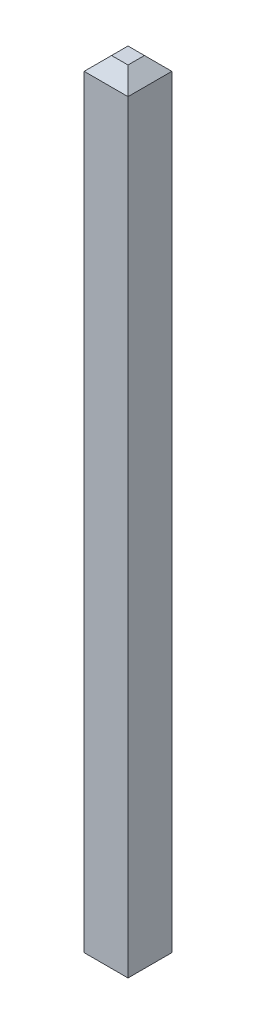
ISO-10303-21;
HEADER;
FILE_DESCRIPTION(('STEP AP214'),'2;1');
FILE_NAME('part.step','',(''),(''),'','','');
FILE_SCHEMA(('AUTOMOTIVE_DESIGN { 1 0 10303 214 1 1 1 1 }'));
ENDSEC;
DATA;
#1=APPLICATION_CONTEXT('core data for automotive mechanical design processes');
#2=APPLICATION_PROTOCOL_DEFINITION('international standard','automotive_design',2000,#1);
#3=PRODUCT_CONTEXT('',#1,'mechanical');
#4=PRODUCT('Part','Part','',(#3));
#5=PRODUCT_RELATED_PRODUCT_CATEGORY('part','',(#4));
#6=PRODUCT_DEFINITION_FORMATION('','',#4);
#7=PRODUCT_DEFINITION_CONTEXT('part definition',#1,'design');
#8=PRODUCT_DEFINITION('design','',#6,#7);
#9=PRODUCT_DEFINITION_SHAPE('','',#8);
#10=(LENGTH_UNIT() NAMED_UNIT(*) SI_UNIT(.MILLI.,.METRE.));
#11=(NAMED_UNIT(*) PLANE_ANGLE_UNIT() SI_UNIT($,.RADIAN.));
#12=(NAMED_UNIT(*) SI_UNIT($,.STERADIAN.) SOLID_ANGLE_UNIT());
#13=UNCERTAINTY_MEASURE_WITH_UNIT(LENGTH_MEASURE(1.E-05),#10,'distance_accuracy_value','');
#14=(GEOMETRIC_REPRESENTATION_CONTEXT(3) GLOBAL_UNCERTAINTY_ASSIGNED_CONTEXT((#13)) GLOBAL_UNIT_ASSIGNED_CONTEXT((#10,
#11,#12)) REPRESENTATION_CONTEXT('',''));
#15=CARTESIAN_POINT('',(0.,0.,0.));
#16=DIRECTION('',(0.,0.,1.));
#17=DIRECTION('',(1.,0.,0.));
#18=AXIS2_PLACEMENT_3D('',#15,#16,#17);
#19=CARTESIAN_POINT('',(0.95,7.27,0.12));
#20=DIRECTION('',(0.,-0.707106781186548,-0.707106781186548));
#21=DIRECTION('',(0.,0.707106781186548,-0.707106781186548));
#22=AXIS2_PLACEMENT_3D('',#19,#20,#21);
#23=PLANE('',#22);
#24=DIRECTION('',(1.,0.,0.));
#25=VECTOR('',#24,1.);
#26=CARTESIAN_POINT('',(0.95,7.27,0.12));
#27=LINE('',#26,#25);
#28=CARTESIAN_POINT('',(1.39,7.27,0.12));
#29=VERTEX_POINT('',#28);
#30=CARTESIAN_POINT('',(1.15,7.27,0.12));
#31=VERTEX_POINT('',#30);
#32=EDGE_CURVE('E79',#29,#31,#27,.F.);
#33=ORIENTED_EDGE('',*,*,#32,.T.);
#34=DIRECTION('',(-0.577350269189626,-0.577350269189625,0.577350269189626));
#35=VECTOR('',#34,1.);
#36=CARTESIAN_POINT('',(1.15,7.27,0.12));
#37=LINE('',#36,#35);
#38=CARTESIAN_POINT('',(0.95,7.07,0.32));
#39=VERTEX_POINT('',#38);
#40=EDGE_CURVE('E20',#31,#39,#37,.T.);
#41=ORIENTED_EDGE('',*,*,#40,.T.);
#42=DIRECTION('',(-1.,0.,0.));
#43=VECTOR('',#42,1.);
#44=CARTESIAN_POINT('',(1.27,7.07,0.320000000000001));
#45=LINE('',#44,#43);
#46=CARTESIAN_POINT('',(1.59,7.07,0.319999999999999));
#47=VERTEX_POINT('',#46);
#48=EDGE_CURVE('E100',#39,#47,#45,.F.);
#49=ORIENTED_EDGE('',*,*,#48,.T.);
#50=DIRECTION('',(-0.577350269189625,0.577350269189626,-0.577350269189627));
#51=VECTOR('',#50,1.);
#52=CARTESIAN_POINT('',(1.59,7.07,0.32));
#53=LINE('',#52,#51);
#54=EDGE_CURVE('E85',#47,#29,#53,.T.);
#55=ORIENTED_EDGE('',*,*,#54,.T.);
#56=EDGE_LOOP('',(#33,#41,#49,#55));
#57=FACE_BOUND('',#56,.T.);
#58=ADVANCED_FACE('F17',(#57),#23,.F.);
#59=CARTESIAN_POINT('',(1.59,-4.27,0.12));
#60=DIRECTION('',(0.,0.707106781186548,-0.707106781186548));
#61=DIRECTION('',(0.,0.707106781186548,0.707106781186548));
#62=AXIS2_PLACEMENT_3D('',#59,#60,#61);
#63=PLANE('',#62);
#64=DIRECTION('',(-1.,0.,0.));
#65=VECTOR('',#64,1.);
#66=CARTESIAN_POINT('',(1.27,-4.07,0.319999999999999));
#67=LINE('',#66,#65);
#68=CARTESIAN_POINT('',(1.59,-4.07,0.32));
#69=VERTEX_POINT('',#68);
#70=CARTESIAN_POINT('',(0.95,-4.07,0.32));
#71=VERTEX_POINT('',#70);
#72=EDGE_CURVE('E98',#69,#71,#67,.T.);
#73=ORIENTED_EDGE('',*,*,#72,.T.);
#74=DIRECTION('',(0.577350269189625,-0.577350269189625,-0.577350269189627));
#75=VECTOR('',#74,1.);
#76=CARTESIAN_POINT('',(0.95,-4.07,0.32));
#77=LINE('',#76,#75);
#78=CARTESIAN_POINT('',(1.15,-4.27,0.12));
#79=VERTEX_POINT('',#78);
#80=EDGE_CURVE('E107',#71,#79,#77,.T.);
#81=ORIENTED_EDGE('',*,*,#80,.T.);
#82=DIRECTION('',(1.,0.,0.));
#83=VECTOR('',#82,1.);
#84=CARTESIAN_POINT('',(1.59,-4.27,0.12));
#85=LINE('',#84,#83);
#86=CARTESIAN_POINT('',(1.39,-4.27,0.12));
#87=VERTEX_POINT('',#86);
#88=EDGE_CURVE('E114',#79,#87,#85,.T.);
#89=ORIENTED_EDGE('',*,*,#88,.T.);
#90=DIRECTION('',(0.577350269189625,0.577350269189625,0.577350269189627));
#91=VECTOR('',#90,1.);
#92=CARTESIAN_POINT('',(1.39,-4.27,0.12));
#93=LINE('',#92,#91);
#94=EDGE_CURVE('E109',#87,#69,#93,.T.);
#95=ORIENTED_EDGE('',*,*,#94,.T.);
#96=EDGE_LOOP('',(#73,#81,#89,#95));
#97=FACE_BOUND('',#96,.T.);
#98=ADVANCED_FACE('F176',(#97),#63,.F.);
#99=CARTESIAN_POINT('',(1.15,7.27,-0.32));
#100=DIRECTION('',(0.707106781186548,-0.707106781186548,0.));
#101=DIRECTION('',(0.707106781186548,0.707106781186548,0.));
#102=AXIS2_PLACEMENT_3D('',#99,#100,#101);
#103=PLANE('',#102);
#104=DIRECTION('',(0.,0.,1.));
#105=VECTOR('',#104,1.);
#106=CARTESIAN_POINT('',(1.15,7.27,-0.32));
#107=LINE('',#106,#105);
#108=CARTESIAN_POINT('',(1.15,7.27,-0.12));
#109=VERTEX_POINT('',#108);
#110=EDGE_CURVE('E87',#31,#109,#107,.F.);
#111=ORIENTED_EDGE('',*,*,#110,.T.);
#112=DIRECTION('',(0.577350269189626,0.577350269189625,0.577350269189627));
#113=VECTOR('',#112,1.);
#114=CARTESIAN_POINT('',(0.95,7.07,-0.320000000000001));
#115=LINE('',#114,#113);
#116=CARTESIAN_POINT('',(0.95,7.07,-0.32));
#117=VERTEX_POINT('',#116);
#118=EDGE_CURVE('E124',#117,#109,#115,.T.);
#119=ORIENTED_EDGE('',*,*,#118,.F.);
#120=DIRECTION('',(0.,0.,-1.));
#121=VECTOR('',#120,1.);
#122=CARTESIAN_POINT('',(0.95,7.07,-0.32));
#123=LINE('',#122,#121);
#124=EDGE_CURVE('E92',#117,#39,#123,.F.);
#125=ORIENTED_EDGE('',*,*,#124,.T.);
#126=ORIENTED_EDGE('',*,*,#40,.F.);
#127=EDGE_LOOP('',(#111,#119,#125,#126));
#128=FACE_BOUND('',#127,.T.);
#129=ADVANCED_FACE('F89',(#128),#103,.F.);
#130=CARTESIAN_POINT('',(0.95,7.27,-0.32));
#131=DIRECTION('',(0.,-1.,0.));
#132=DIRECTION('',(1.,0.,0.));
#133=AXIS2_PLACEMENT_3D('',#130,#131,#132);
#134=PLANE('',#133);
#135=DIRECTION('',(1.,0.,0.));
#136=VECTOR('',#135,1.);
#137=CARTESIAN_POINT('',(1.27,7.27,-0.120000000000001));
#138=LINE('',#137,#136);
#139=CARTESIAN_POINT('',(1.39,7.27,-0.12));
#140=VERTEX_POINT('',#139);
#141=EDGE_CURVE('E96',#109,#140,#138,.T.);
#142=ORIENTED_EDGE('',*,*,#141,.F.);
#143=ORIENTED_EDGE('',*,*,#110,.F.);
#144=ORIENTED_EDGE('',*,*,#32,.F.);
#145=DIRECTION('',(0.,0.,1.));
#146=VECTOR('',#145,1.);
#147=CARTESIAN_POINT('',(1.39,7.27,-0.32));
#148=LINE('',#147,#146);
#149=EDGE_CURVE('E104',#29,#140,#148,.F.);
#150=ORIENTED_EDGE('',*,*,#149,.T.);
#151=EDGE_LOOP('',(#142,#143,#144,#150));
#152=FACE_BOUND('',#151,.T.);
#153=ADVANCED_FACE('F94',(#152),#134,.F.);
#154=CARTESIAN_POINT('',(1.27,1.5,0.32));
#155=DIRECTION('',(0.,0.,-1.));
#156=DIRECTION('',(-1.,0.,0.));
#157=AXIS2_PLACEMENT_3D('',#154,#155,#156);
#158=PLANE('',#157);
#159=ORIENTED_EDGE('',*,*,#48,.F.);
#160=DIRECTION('',(0.,1.,0.));
#161=VECTOR('',#160,1.);
#162=CARTESIAN_POINT('',(0.95,-4.27,0.32));
#163=LINE('',#162,#161);
#164=EDGE_CURVE('E121',#39,#71,#163,.F.);
#165=ORIENTED_EDGE('',*,*,#164,.T.);
#166=ORIENTED_EDGE('',*,*,#72,.F.);
#167=DIRECTION('',(0.,-1.,0.));
#168=VECTOR('',#167,1.);
#169=CARTESIAN_POINT('',(1.59,7.27,0.32));
#170=LINE('',#169,#168);
#171=EDGE_CURVE('E132',#69,#47,#170,.F.);
#172=ORIENTED_EDGE('',*,*,#171,.T.);
#173=EDGE_LOOP('',(#159,#165,#166,#172));
#174=FACE_BOUND('',#173,.T.);
#175=ADVANCED_FACE('F213',(#174),#158,.F.);
#176=CARTESIAN_POINT('',(1.59,7.07,-0.32));
#177=DIRECTION('',(-0.707106781186548,-0.707106781186548,0.));
#178=DIRECTION('',(0.707106781186548,-0.707106781186548,0.));
#179=AXIS2_PLACEMENT_3D('',#176,#177,#178);
#180=PLANE('',#179);
#181=DIRECTION('',(0.,0.,1.));
#182=VECTOR('',#181,1.);
#183=CARTESIAN_POINT('',(1.59,7.07,-0.32));
#184=LINE('',#183,#182);
#185=CARTESIAN_POINT('',(1.59,7.07,-0.319999999999999));
#186=VERTEX_POINT('',#185);
#187=EDGE_CURVE('E135',#47,#186,#184,.F.);
#188=ORIENTED_EDGE('',*,*,#187,.T.);
#189=DIRECTION('',(0.577350269189628,-0.577350269189626,-0.577350269189623));
#190=VECTOR('',#189,1.);
#191=CARTESIAN_POINT('',(1.39,7.27,-0.12));
#192=LINE('',#191,#190);
#193=EDGE_CURVE('E127',#140,#186,#192,.T.);
#194=ORIENTED_EDGE('',*,*,#193,.F.);
#195=ORIENTED_EDGE('',*,*,#149,.F.);
#196=ORIENTED_EDGE('',*,*,#54,.F.);
#197=EDGE_LOOP('',(#188,#194,#195,#196));
#198=FACE_BOUND('',#197,.T.);
#199=ADVANCED_FACE('F188',(#198),#180,.F.);
#200=CARTESIAN_POINT('',(0.95,-4.07,-0.32));
#201=DIRECTION('',(0.707106781186548,0.707106781186548,0.));
#202=DIRECTION('',(-0.707106781186548,0.707106781186548,0.));
#203=AXIS2_PLACEMENT_3D('',#200,#201,#202);
#204=PLANE('',#203);
#205=DIRECTION('',(0.,0.,1.));
#206=VECTOR('',#205,1.);
#207=CARTESIAN_POINT('',(1.15,-4.27,-0.32));
#208=LINE('',#207,#206);
#209=CARTESIAN_POINT('',(1.15,-4.27,-0.12));
#210=VERTEX_POINT('',#209);
#211=EDGE_CURVE('E111',#210,#79,#208,.T.);
#212=ORIENTED_EDGE('',*,*,#211,.T.);
#213=ORIENTED_EDGE('',*,*,#80,.F.);
#214=DIRECTION('',(0.,0.,-1.));
#215=VECTOR('',#214,1.);
#216=CARTESIAN_POINT('',(0.95,-4.07,-0.32));
#217=LINE('',#216,#215);
#218=CARTESIAN_POINT('',(0.95,-4.07,-0.32));
#219=VERTEX_POINT('',#218);
#220=EDGE_CURVE('E118',#71,#219,#217,.T.);
#221=ORIENTED_EDGE('',*,*,#220,.T.);
#222=DIRECTION('',(-0.577350269189626,0.577350269189625,-0.577350269189626));
#223=VECTOR('',#222,1.);
#224=CARTESIAN_POINT('',(1.15,-4.27,-0.120000000000001));
#225=LINE('',#224,#223);
#226=EDGE_CURVE('E137',#210,#219,#225,.T.);
#227=ORIENTED_EDGE('',*,*,#226,.F.);
#228=EDGE_LOOP('',(#212,#213,#221,#227));
#229=FACE_BOUND('',#228,.T.);
#230=ADVANCED_FACE('F167',(#229),#204,.F.);
#231=CARTESIAN_POINT('',(1.39,-4.27,-0.32));
#232=DIRECTION('',(-0.707106781186548,0.707106781186548,0.));
#233=DIRECTION('',(-0.707106781186548,-0.707106781186548,0.));
#234=AXIS2_PLACEMENT_3D('',#231,#232,#233);
#235=PLANE('',#234);
#236=DIRECTION('',(0.,0.,1.));
#237=VECTOR('',#236,1.);
#238=CARTESIAN_POINT('',(1.59000000000001,-4.07,-0.32));
#239=LINE('',#238,#237);
#240=CARTESIAN_POINT('',(1.59,-4.07,-0.32));
#241=VERTEX_POINT('',#240);
#242=EDGE_CURVE('E130',#241,#69,#239,.T.);
#243=ORIENTED_EDGE('',*,*,#242,.T.);
#244=ORIENTED_EDGE('',*,*,#94,.F.);
#245=DIRECTION('',(0.,0.,1.));
#246=VECTOR('',#245,1.);
#247=CARTESIAN_POINT('',(1.39,-4.27,-0.32));
#248=LINE('',#247,#246);
#249=CARTESIAN_POINT('',(1.39,-4.27,-0.12));
#250=VERTEX_POINT('',#249);
#251=EDGE_CURVE('E116',#87,#250,#248,.F.);
#252=ORIENTED_EDGE('',*,*,#251,.T.);
#253=DIRECTION('',(-0.577350269189627,-0.577350269189626,0.577350269189624));
#254=VECTOR('',#253,1.);
#255=CARTESIAN_POINT('',(1.59,-4.07,-0.32));
#256=LINE('',#255,#254);
#257=EDGE_CURVE('E35',#241,#250,#256,.T.);
#258=ORIENTED_EDGE('',*,*,#257,.F.);
#259=EDGE_LOOP('',(#243,#244,#252,#258));
#260=FACE_BOUND('',#259,.T.);
#261=ADVANCED_FACE('F177',(#260),#235,.F.);
#262=CARTESIAN_POINT('',(1.59,-4.27,-0.32));
#263=DIRECTION('',(0.,1.,0.));
#264=DIRECTION('',(0.,0.,1.));
#265=AXIS2_PLACEMENT_3D('',#262,#263,#264);
#266=PLANE('',#265);
#267=ORIENTED_EDGE('',*,*,#88,.F.);
#268=ORIENTED_EDGE('',*,*,#211,.F.);
#269=DIRECTION('',(1.,0.,0.));
#270=VECTOR('',#269,1.);
#271=CARTESIAN_POINT('',(1.27,-4.27,-0.12));
#272=LINE('',#271,#270);
#273=EDGE_CURVE('E141',#250,#210,#272,.F.);
#274=ORIENTED_EDGE('',*,*,#273,.F.);
#275=ORIENTED_EDGE('',*,*,#251,.F.);
#276=EDGE_LOOP('',(#267,#268,#274,#275));
#277=FACE_BOUND('',#276,.T.);
#278=ADVANCED_FACE('F173',(#277),#266,.F.);
#279=CARTESIAN_POINT('',(0.95,-4.27,-0.32));
#280=DIRECTION('',(1.,0.,0.));
#281=DIRECTION('',(0.,0.,-1.));
#282=AXIS2_PLACEMENT_3D('',#279,#280,#281);
#283=PLANE('',#282);
#284=ORIENTED_EDGE('',*,*,#124,.F.);
#285=DIRECTION('',(0.,1.,0.));
#286=VECTOR('',#285,1.);
#287=CARTESIAN_POINT('',(0.95,1.5,-0.32));
#288=LINE('',#287,#286);
#289=EDGE_CURVE('E144',#219,#117,#288,.T.);
#290=ORIENTED_EDGE('',*,*,#289,.F.);
#291=ORIENTED_EDGE('',*,*,#220,.F.);
#292=ORIENTED_EDGE('',*,*,#164,.F.);
#293=EDGE_LOOP('',(#284,#290,#291,#292));
#294=FACE_BOUND('',#293,.T.);
#295=ADVANCED_FACE('F186',(#294),#283,.F.);
#296=CARTESIAN_POINT('',(1.27,7.07,-0.32));
#297=DIRECTION('',(0.,0.707106781186548,-0.707106781186548));
#298=DIRECTION('',(0.,0.707106781186548,0.707106781186548));
#299=AXIS2_PLACEMENT_3D('',#296,#297,#298);
#300=PLANE('',#299);
#301=ORIENTED_EDGE('',*,*,#193,.T.);
#302=DIRECTION('',(-1.,0.,0.));
#303=VECTOR('',#302,1.);
#304=CARTESIAN_POINT('',(1.27,7.07,-0.319999999999999));
#305=LINE('',#304,#303);
#306=EDGE_CURVE('E147',#117,#186,#305,.F.);
#307=ORIENTED_EDGE('',*,*,#306,.F.);
#308=ORIENTED_EDGE('',*,*,#118,.T.);
#309=ORIENTED_EDGE('',*,*,#141,.T.);
#310=EDGE_LOOP('',(#301,#307,#308,#309));
#311=FACE_BOUND('',#310,.T.);
#312=ADVANCED_FACE('F200',(#311),#300,.T.);
#313=CARTESIAN_POINT('',(1.59,7.27,-0.32));
#314=DIRECTION('',(-1.,0.,0.));
#315=DIRECTION('',(0.,-1.,0.));
#316=AXIS2_PLACEMENT_3D('',#313,#314,#315);
#317=PLANE('',#316);
#318=ORIENTED_EDGE('',*,*,#187,.F.);
#319=ORIENTED_EDGE('',*,*,#171,.F.);
#320=ORIENTED_EDGE('',*,*,#242,.F.);
#321=DIRECTION('',(0.,1.,0.));
#322=VECTOR('',#321,1.);
#323=CARTESIAN_POINT('',(1.59,1.5,-0.32));
#324=LINE('',#323,#322);
#325=EDGE_CURVE('E26',#186,#241,#324,.F.);
#326=ORIENTED_EDGE('',*,*,#325,.F.);
#327=EDGE_LOOP('',(#318,#319,#320,#326));
#328=FACE_BOUND('',#327,.T.);
#329=ADVANCED_FACE('F158',(#328),#317,.F.);
#330=CARTESIAN_POINT('',(1.27,-4.07,-0.32));
#331=DIRECTION('',(0.,-0.707106781186548,-0.707106781186548));
#332=DIRECTION('',(0.,0.707106781186548,-0.707106781186548));
#333=AXIS2_PLACEMENT_3D('',#330,#331,#332);
#334=PLANE('',#333);
#335=ORIENTED_EDGE('',*,*,#257,.T.);
#336=ORIENTED_EDGE('',*,*,#273,.T.);
#337=ORIENTED_EDGE('',*,*,#226,.T.);
#338=DIRECTION('',(-1.,0.,0.));
#339=VECTOR('',#338,1.);
#340=CARTESIAN_POINT('',(1.27,-4.07,-0.320000000000001));
#341=LINE('',#340,#339);
#342=EDGE_CURVE('E11',#241,#219,#341,.T.);
#343=ORIENTED_EDGE('',*,*,#342,.F.);
#344=EDGE_LOOP('',(#335,#336,#337,#343));
#345=FACE_BOUND('',#344,.T.);
#346=ADVANCED_FACE('F163',(#345),#334,.T.);
#347=CARTESIAN_POINT('',(1.27,1.5,-0.32));
#348=DIRECTION('',(0.,0.,-1.));
#349=DIRECTION('',(-1.,0.,0.));
#350=AXIS2_PLACEMENT_3D('',#347,#348,#349);
#351=PLANE('',#350);
#352=ORIENTED_EDGE('',*,*,#325,.T.);
#353=ORIENTED_EDGE('',*,*,#342,.T.);
#354=ORIENTED_EDGE('',*,*,#289,.T.);
#355=ORIENTED_EDGE('',*,*,#306,.T.);
#356=EDGE_LOOP('',(#352,#353,#354,#355));
#357=FACE_BOUND('',#356,.T.);
#358=ADVANCED_FACE('F153',(#357),#351,.T.);
#359=CLOSED_SHELL('',(#58,#98,#129,#153,#175,#199,#230,#261,#278,#295,#312,#329,#346,#358));
#360=MANIFOLD_SOLID_BREP('B1',#359);
#361=ADVANCED_BREP_SHAPE_REPRESENTATION('',(#18,#360),#14);
#362=SHAPE_DEFINITION_REPRESENTATION(#9,#361);
ENDSEC;
END-ISO-10303-21;
